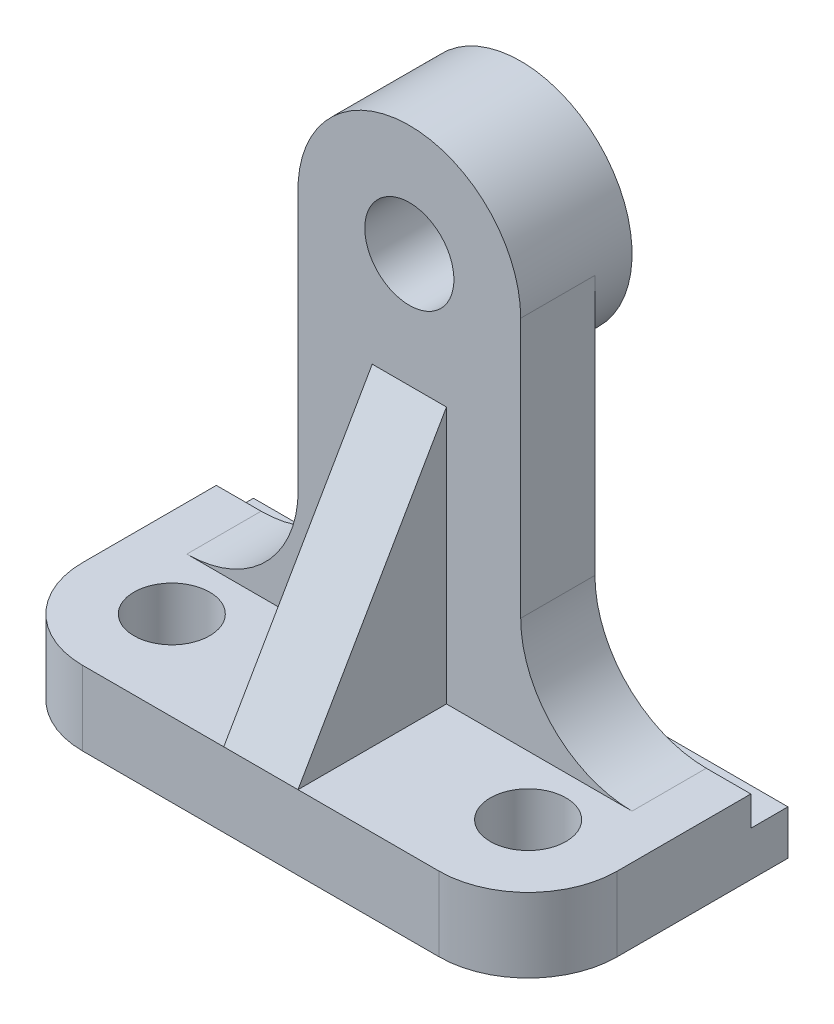
ISO-10303-21;
HEADER;
FILE_DESCRIPTION(('STEP AP214'),'2;1');
FILE_NAME('part.step','',(''),(''),'','','');
FILE_SCHEMA(('AUTOMOTIVE_DESIGN { 1 0 10303 214 1 1 1 1 }'));
ENDSEC;
DATA;
#1=APPLICATION_CONTEXT('core data for automotive mechanical design processes');
#2=APPLICATION_PROTOCOL_DEFINITION('international standard','automotive_design',2000,#1);
#3=PRODUCT_CONTEXT('',#1,'mechanical');
#4=PRODUCT('Part','Part','',(#3));
#5=PRODUCT_RELATED_PRODUCT_CATEGORY('part','',(#4));
#6=PRODUCT_DEFINITION_FORMATION('','',#4);
#7=PRODUCT_DEFINITION_CONTEXT('part definition',#1,'design');
#8=PRODUCT_DEFINITION('design','',#6,#7);
#9=PRODUCT_DEFINITION_SHAPE('','',#8);
#10=(LENGTH_UNIT() NAMED_UNIT(*) SI_UNIT(.MILLI.,.METRE.));
#11=(NAMED_UNIT(*) PLANE_ANGLE_UNIT() SI_UNIT($,.RADIAN.));
#12=(NAMED_UNIT(*) SI_UNIT($,.STERADIAN.) SOLID_ANGLE_UNIT());
#13=UNCERTAINTY_MEASURE_WITH_UNIT(LENGTH_MEASURE(1.E-05),#10,'distance_accuracy_value','');
#14=(GEOMETRIC_REPRESENTATION_CONTEXT(3) GLOBAL_UNCERTAINTY_ASSIGNED_CONTEXT((#13)) GLOBAL_UNIT_ASSIGNED_CONTEXT((#10,
#11,#12)) REPRESENTATION_CONTEXT('',''));
#15=CARTESIAN_POINT('',(0.,0.,0.));
#16=DIRECTION('',(0.,0.,1.));
#17=DIRECTION('',(1.,0.,0.));
#18=AXIS2_PLACEMENT_3D('',#15,#16,#17);
#19=CARTESIAN_POINT('',(0.,10.,0.));
#20=DIRECTION('',(0.,1.,0.));
#21=DIRECTION('',(0.,0.,1.));
#22=AXIS2_PLACEMENT_3D('',#19,#20,#21);
#23=PLANE('',#22);
#24=CARTESIAN_POINT('',(-24.,10.,5.5));
#25=DIRECTION('',(0.,1.,0.));
#26=DIRECTION('',(0.,0.,1.));
#27=AXIS2_PLACEMENT_3D('',#24,#25,#26);
#28=CIRCLE('',#27,5.09999999999999);
#29=CARTESIAN_POINT('',(-24.,10.,10.6));
#30=VERTEX_POINT('',#29);
#31=EDGE_CURVE('E449',#30,#30,#28,.T.);
#32=ORIENTED_EDGE('',*,*,#31,.F.);
#33=EDGE_LOOP('',(#32));
#34=FACE_BOUND('',#33,.T.);
#35=DIRECTION('',(1.,0.,0.));
#36=VECTOR('',#35,1.);
#37=CARTESIAN_POINT('',(-36.,10.,17.5));
#38=LINE('',#37,#36);
#39=CARTESIAN_POINT('',(-24.,10.,17.5));
#40=VERTEX_POINT('',#39);
#41=CARTESIAN_POINT('',(-5.,10.,17.5));
#42=VERTEX_POINT('',#41);
#43=EDGE_CURVE('E190',#40,#42,#38,.T.);
#44=ORIENTED_EDGE('',*,*,#43,.T.);
#45=DIRECTION('',(0.,0.,-1.));
#46=VECTOR('',#45,1.);
#47=CARTESIAN_POINT('',(-5.,10.,0.));
#48=LINE('',#47,#46);
#49=CARTESIAN_POINT('',(-5.,10.,-2.5));
#50=VERTEX_POINT('',#49);
#51=EDGE_CURVE('E165',#42,#50,#48,.T.);
#52=ORIENTED_EDGE('',*,*,#51,.T.);
#53=DIRECTION('',(-1.,0.,0.));
#54=VECTOR('',#53,1.);
#55=CARTESIAN_POINT('',(-14.9709910407704,10.,-2.49999999999999));
#56=LINE('',#55,#54);
#57=CARTESIAN_POINT('',(-29.9709910407704,10.,-2.49999999999999));
#58=VERTEX_POINT('',#57);
#59=EDGE_CURVE('E319',#50,#58,#56,.T.);
#60=ORIENTED_EDGE('',*,*,#59,.T.);
#61=DIRECTION('',(0.,0.,-1.));
#62=VECTOR('',#61,1.);
#63=CARTESIAN_POINT('',(-29.9709910407704,10.,-12.5));
#64=LINE('',#63,#62);
#65=CARTESIAN_POINT('',(-29.9709910407704,10.,-12.5));
#66=VERTEX_POINT('',#65);
#67=EDGE_CURVE('E268',#58,#66,#64,.T.);
#68=ORIENTED_EDGE('',*,*,#67,.T.);
#69=DIRECTION('',(1.,0.,0.));
#70=VECTOR('',#69,1.);
#71=CARTESIAN_POINT('',(0.,10.,-12.5));
#72=LINE('',#71,#70);
#73=CARTESIAN_POINT('',(-36.,10.,-12.5));
#74=VERTEX_POINT('',#73);
#75=EDGE_CURVE('E256',#74,#66,#72,.T.);
#76=ORIENTED_EDGE('',*,*,#75,.F.);
#77=DIRECTION('',(0.,0.,1.));
#78=VECTOR('',#77,1.);
#79=CARTESIAN_POINT('',(-36.,10.,-17.5));
#80=LINE('',#79,#78);
#81=CARTESIAN_POINT('',(-36.,10.,5.5));
#82=VERTEX_POINT('',#81);
#83=EDGE_CURVE('E207',#74,#82,#80,.T.);
#84=ORIENTED_EDGE('',*,*,#83,.T.);
#85=CARTESIAN_POINT('',(-24.,10.,5.5));
#86=DIRECTION('',(0.,1.,0.));
#87=DIRECTION('',(0.,0.,1.));
#88=AXIS2_PLACEMENT_3D('',#85,#86,#87);
#89=CIRCLE('',#88,12.);
#90=EDGE_CURVE('E198',#82,#40,#89,.T.);
#91=ORIENTED_EDGE('',*,*,#90,.T.);
#92=EDGE_LOOP('',(#44,#52,#60,#68,#76,#84,#91));
#93=FACE_BOUND('',#92,.T.);
#94=ADVANCED_FACE('F43',(#34,#93),#23,.T.);
#95=CARTESIAN_POINT('',(-53.0000000000001,10.,-12.5));
#96=DIRECTION('',(0.,0.,1.));
#97=DIRECTION('',(1.,0.,0.));
#98=AXIS2_PLACEMENT_3D('',#95,#96,#97);
#99=PLANE('',#98);
#100=DIRECTION('',(0.,-1.,0.));
#101=VECTOR('',#100,1.);
#102=CARTESIAN_POINT('',(36.,10.,-12.5));
#103=LINE('',#102,#101);
#104=CARTESIAN_POINT('',(36.,10.,-12.5));
#105=VERTEX_POINT('',#104);
#106=CARTESIAN_POINT('',(36.,6.,-12.5));
#107=VERTEX_POINT('',#106);
#108=EDGE_CURVE('E340',#105,#107,#103,.T.);
#109=ORIENTED_EDGE('',*,*,#108,.T.);
#110=DIRECTION('',(1.,0.,0.));
#111=VECTOR('',#110,1.);
#112=CARTESIAN_POINT('',(-53.0000000000001,6.,-12.5));
#113=LINE('',#112,#111);
#114=CARTESIAN_POINT('',(-36.,6.,-12.5));
#115=VERTEX_POINT('',#114);
#116=EDGE_CURVE('E349',#115,#107,#113,.T.);
#117=ORIENTED_EDGE('',*,*,#116,.F.);
#118=DIRECTION('',(0.,-1.,0.));
#119=VECTOR('',#118,1.);
#120=CARTESIAN_POINT('',(-36.,10.,-12.5));
#121=LINE('',#120,#119);
#122=EDGE_CURVE('E216',#74,#115,#121,.T.);
#123=ORIENTED_EDGE('',*,*,#122,.F.);
#124=ORIENTED_EDGE('',*,*,#75,.T.);
#125=CARTESIAN_POINT('',(-29.9709910407704,25.,-12.5));
#126=DIRECTION('',(0.,0.,1.));
#127=DIRECTION('',(1.,0.,0.));
#128=AXIS2_PLACEMENT_3D('',#125,#126,#127);
#129=CIRCLE('',#128,15.);
#130=CARTESIAN_POINT('',(-14.9709910407704,25.,-12.5));
#131=VERTEX_POINT('',#130);
#132=EDGE_CURVE('E279',#66,#131,#129,.T.);
#133=ORIENTED_EDGE('',*,*,#132,.T.);
#134=DIRECTION('',(0.,1.,0.));
#135=VECTOR('',#134,1.);
#136=CARTESIAN_POINT('',(-14.9709910407704,60.9324308323795,-12.5));
#137=LINE('',#136,#135);
#138=CARTESIAN_POINT('',(-14.9709910407704,59.0675691676204,-12.5));
#139=VERTEX_POINT('',#138);
#140=EDGE_CURVE('E331',#131,#139,#137,.T.);
#141=ORIENTED_EDGE('',*,*,#140,.T.);
#142=CARTESIAN_POINT('',(0.,60.,-12.5));
#143=DIRECTION('',(0.,0.,-1.));
#144=DIRECTION('',(-1.,0.,0.));
#145=AXIS2_PLACEMENT_3D('',#142,#143,#144);
#146=CIRCLE('',#145,15.);
#147=CARTESIAN_POINT('',(15.,60.,-12.5));
#148=VERTEX_POINT('',#147);
#149=EDGE_CURVE('E67',#148,#139,#146,.T.);
#150=ORIENTED_EDGE('',*,*,#149,.F.);
#151=DIRECTION('',(0.,-1.,0.));
#152=VECTOR('',#151,1.);
#153=CARTESIAN_POINT('',(15.,10.,-12.5));
#154=LINE('',#153,#152);
#155=CARTESIAN_POINT('',(15.,25.,-12.5));
#156=VERTEX_POINT('',#155);
#157=EDGE_CURVE('E292',#148,#156,#154,.T.);
#158=ORIENTED_EDGE('',*,*,#157,.T.);
#159=CARTESIAN_POINT('',(30.,25.,-12.5));
#160=DIRECTION('',(0.,0.,1.));
#161=DIRECTION('',(1.,0.,0.));
#162=AXIS2_PLACEMENT_3D('',#159,#160,#161);
#163=CIRCLE('',#162,15.);
#164=CARTESIAN_POINT('',(30.,10.,-12.5));
#165=VERTEX_POINT('',#164);
#166=EDGE_CURVE('E52',#156,#165,#163,.T.);
#167=ORIENTED_EDGE('',*,*,#166,.T.);
#168=EDGE_CURVE('E255',#165,#105,#72,.T.);
#169=ORIENTED_EDGE('',*,*,#168,.T.);
#170=EDGE_LOOP('',(#109,#117,#123,#124,#133,#141,#150,#158,#167,#169));
#171=FACE_BOUND('',#170,.T.);
#172=ADVANCED_FACE('F290',(#171),#99,.F.);
#173=CARTESIAN_POINT('',(36.,10.,-17.5));
#174=DIRECTION('',(-1.,0.,0.));
#175=DIRECTION('',(0.,0.,1.));
#176=AXIS2_PLACEMENT_3D('',#173,#174,#175);
#177=PLANE('',#176);
#178=DIRECTION('',(0.,-1.,0.));
#179=VECTOR('',#178,1.);
#180=CARTESIAN_POINT('',(36.,10.,-17.5));
#181=LINE('',#180,#179);
#182=CARTESIAN_POINT('',(36.,6.,-17.5));
#183=VERTEX_POINT('',#182);
#184=CARTESIAN_POINT('',(36.,0.,-17.5));
#185=VERTEX_POINT('',#184);
#186=EDGE_CURVE('E205',#183,#185,#181,.T.);
#187=ORIENTED_EDGE('',*,*,#186,.F.);
#188=DIRECTION('',(0.,0.,-1.));
#189=VECTOR('',#188,1.);
#190=CARTESIAN_POINT('',(36.,6.,-17.5));
#191=LINE('',#190,#189);
#192=EDGE_CURVE('E345',#107,#183,#191,.T.);
#193=ORIENTED_EDGE('',*,*,#192,.F.);
#194=ORIENTED_EDGE('',*,*,#108,.F.);
#195=DIRECTION('',(0.,0.,-1.));
#196=VECTOR('',#195,1.);
#197=CARTESIAN_POINT('',(36.,10.,-17.5));
#198=LINE('',#197,#196);
#199=CARTESIAN_POINT('',(36.,10.,5.5));
#200=VERTEX_POINT('',#199);
#201=EDGE_CURVE('E225',#200,#105,#198,.T.);
#202=ORIENTED_EDGE('',*,*,#201,.F.);
#203=DIRECTION('',(0.,-1.,0.));
#204=VECTOR('',#203,1.);
#205=CARTESIAN_POINT('',(36.,10.,5.5));
#206=LINE('',#205,#204);
#207=CARTESIAN_POINT('',(36.,0.,5.5));
#208=VERTEX_POINT('',#207);
#209=EDGE_CURVE('E251',#200,#208,#206,.T.);
#210=ORIENTED_EDGE('',*,*,#209,.T.);
#211=DIRECTION('',(0.,0.,-1.));
#212=VECTOR('',#211,1.);
#213=CARTESIAN_POINT('',(36.,0.,-17.5));
#214=LINE('',#213,#212);
#215=EDGE_CURVE('E211',#208,#185,#214,.T.);
#216=ORIENTED_EDGE('',*,*,#215,.T.);
#217=EDGE_LOOP('',(#187,#193,#194,#202,#210,#216));
#218=FACE_BOUND('',#217,.T.);
#219=ADVANCED_FACE('F380',(#218),#177,.F.);
#220=CARTESIAN_POINT('',(-36.,10.,-17.5));
#221=DIRECTION('',(0.,0.,1.));
#222=DIRECTION('',(1.,0.,0.));
#223=AXIS2_PLACEMENT_3D('',#220,#221,#222);
#224=PLANE('',#223);
#225=DIRECTION('',(-1.,0.,0.));
#226=VECTOR('',#225,1.);
#227=CARTESIAN_POINT('',(-36.,0.,-17.5));
#228=LINE('',#227,#226);
#229=CARTESIAN_POINT('',(-36.,0.,-17.5));
#230=VERTEX_POINT('',#229);
#231=EDGE_CURVE('E215',#185,#230,#228,.T.);
#232=ORIENTED_EDGE('',*,*,#231,.T.);
#233=DIRECTION('',(0.,-1.,0.));
#234=VECTOR('',#233,1.);
#235=CARTESIAN_POINT('',(-36.,10.,-17.5));
#236=LINE('',#235,#234);
#237=CARTESIAN_POINT('',(-36.,6.,-17.5));
#238=VERTEX_POINT('',#237);
#239=EDGE_CURVE('E200',#238,#230,#236,.T.);
#240=ORIENTED_EDGE('',*,*,#239,.F.);
#241=DIRECTION('',(1.,0.,0.));
#242=VECTOR('',#241,1.);
#243=CARTESIAN_POINT('',(-53.0000000000001,6.,-17.5));
#244=LINE('',#243,#242);
#245=EDGE_CURVE('E350',#238,#183,#244,.T.);
#246=ORIENTED_EDGE('',*,*,#245,.T.);
#247=ORIENTED_EDGE('',*,*,#186,.T.);
#248=EDGE_LOOP('',(#232,#240,#246,#247));
#249=FACE_BOUND('',#248,.T.);
#250=ADVANCED_FACE('F386',(#249),#224,.F.);
#251=CARTESIAN_POINT('',(-36.,10.,-17.5));
#252=DIRECTION('',(1.,0.,0.));
#253=DIRECTION('',(0.,0.,-1.));
#254=AXIS2_PLACEMENT_3D('',#251,#252,#253);
#255=PLANE('',#254);
#256=ORIENTED_EDGE('',*,*,#122,.T.);
#257=DIRECTION('',(0.,0.,-1.));
#258=VECTOR('',#257,1.);
#259=CARTESIAN_POINT('',(-36.,6.,-17.5));
#260=LINE('',#259,#258);
#261=EDGE_CURVE('E260',#115,#238,#260,.T.);
#262=ORIENTED_EDGE('',*,*,#261,.T.);
#263=ORIENTED_EDGE('',*,*,#239,.T.);
#264=DIRECTION('',(0.,0.,1.));
#265=VECTOR('',#264,1.);
#266=CARTESIAN_POINT('',(-36.,0.,-17.5));
#267=LINE('',#266,#265);
#268=CARTESIAN_POINT('',(-36.,0.,5.5));
#269=VERTEX_POINT('',#268);
#270=EDGE_CURVE('E219',#230,#269,#267,.T.);
#271=ORIENTED_EDGE('',*,*,#270,.T.);
#272=DIRECTION('',(0.,-1.,0.));
#273=VECTOR('',#272,1.);
#274=CARTESIAN_POINT('',(-36.,10.,5.5));
#275=LINE('',#274,#273);
#276=EDGE_CURVE('E242',#269,#82,#275,.F.);
#277=ORIENTED_EDGE('',*,*,#276,.T.);
#278=ORIENTED_EDGE('',*,*,#83,.F.);
#279=EDGE_LOOP('',(#256,#262,#263,#271,#277,#278));
#280=FACE_BOUND('',#279,.T.);
#281=ADVANCED_FACE('F363',(#280),#255,.F.);
#282=CARTESIAN_POINT('',(-36.,10.,17.5));
#283=DIRECTION('',(0.,0.,-1.));
#284=DIRECTION('',(-1.,0.,0.));
#285=AXIS2_PLACEMENT_3D('',#282,#283,#284);
#286=PLANE('',#285);
#287=CARTESIAN_POINT('',(5.,10.,17.5));
#288=VERTEX_POINT('',#287);
#289=CARTESIAN_POINT('',(24.,10.,17.5));
#290=VERTEX_POINT('',#289);
#291=EDGE_CURVE('E193',#288,#290,#38,.T.);
#292=ORIENTED_EDGE('',*,*,#291,.F.);
#293=DIRECTION('',(-1.,0.,0.));
#294=VECTOR('',#293,1.);
#295=CARTESIAN_POINT('',(0.,10.,17.5));
#296=LINE('',#295,#294);
#297=EDGE_CURVE('E179',#42,#288,#296,.F.);
#298=ORIENTED_EDGE('',*,*,#297,.F.);
#299=ORIENTED_EDGE('',*,*,#43,.F.);
#300=DIRECTION('',(0.,-1.,0.));
#301=VECTOR('',#300,1.);
#302=CARTESIAN_POINT('',(-24.,10.,17.5));
#303=LINE('',#302,#301);
#304=CARTESIAN_POINT('',(-24.,0.,17.5));
#305=VERTEX_POINT('',#304);
#306=EDGE_CURVE('E232',#40,#305,#303,.T.);
#307=ORIENTED_EDGE('',*,*,#306,.T.);
#308=DIRECTION('',(1.,0.,0.));
#309=VECTOR('',#308,1.);
#310=CARTESIAN_POINT('',(-36.,0.,17.5));
#311=LINE('',#310,#309);
#312=CARTESIAN_POINT('',(24.,0.,17.5));
#313=VERTEX_POINT('',#312);
#314=EDGE_CURVE('E223',#305,#313,#311,.T.);
#315=ORIENTED_EDGE('',*,*,#314,.T.);
#316=DIRECTION('',(0.,-1.,0.));
#317=VECTOR('',#316,1.);
#318=CARTESIAN_POINT('',(24.,10.,17.5));
#319=LINE('',#318,#317);
#320=EDGE_CURVE('E229',#313,#290,#319,.F.);
#321=ORIENTED_EDGE('',*,*,#320,.T.);
#322=EDGE_LOOP('',(#292,#298,#299,#307,#315,#321));
#323=FACE_BOUND('',#322,.T.);
#324=ADVANCED_FACE('F188',(#323),#286,.F.);
#325=DIRECTION('',(0.,0.,-1.));
#326=VECTOR('',#325,1.);
#327=CARTESIAN_POINT('',(5.,10.,0.));
#328=LINE('',#327,#326);
#329=CARTESIAN_POINT('',(5.,10.,-2.5));
#330=VERTEX_POINT('',#329);
#331=EDGE_CURVE('E479',#288,#330,#328,.T.);
#332=ORIENTED_EDGE('',*,*,#331,.F.);
#333=ORIENTED_EDGE('',*,*,#291,.T.);
#334=CARTESIAN_POINT('',(24.,10.,5.5));
#335=DIRECTION('',(0.,1.,0.));
#336=DIRECTION('',(0.,0.,1.));
#337=AXIS2_PLACEMENT_3D('',#334,#335,#336);
#338=CIRCLE('',#337,12.);
#339=EDGE_CURVE('E246',#290,#200,#338,.T.);
#340=ORIENTED_EDGE('',*,*,#339,.T.);
#341=ORIENTED_EDGE('',*,*,#201,.T.);
#342=ORIENTED_EDGE('',*,*,#168,.F.);
#343=DIRECTION('',(0.,0.,-1.));
#344=VECTOR('',#343,1.);
#345=CARTESIAN_POINT('',(30.,10.,-2.5));
#346=LINE('',#345,#344);
#347=CARTESIAN_POINT('',(30.,10.,-2.5));
#348=VERTEX_POINT('',#347);
#349=EDGE_CURVE('E264',#165,#348,#346,.F.);
#350=ORIENTED_EDGE('',*,*,#349,.T.);
#351=EDGE_CURVE('E314',#348,#330,#56,.T.);
#352=ORIENTED_EDGE('',*,*,#351,.T.);
#353=EDGE_LOOP('',(#332,#333,#340,#341,#342,#350,#352));
#354=FACE_BOUND('',#353,.T.);
#355=CARTESIAN_POINT('',(24.,10.,5.5));
#356=DIRECTION('',(0.,1.,0.));
#357=DIRECTION('',(0.,0.,1.));
#358=AXIS2_PLACEMENT_3D('',#355,#356,#357);
#359=CIRCLE('',#358,5.09999999999999);
#360=CARTESIAN_POINT('',(24.,10.,10.6));
#361=VERTEX_POINT('',#360);
#362=EDGE_CURVE('E457',#361,#361,#359,.T.);
#363=ORIENTED_EDGE('',*,*,#362,.F.);
#364=EDGE_LOOP('',(#363));
#365=FACE_BOUND('',#364,.T.);
#366=ADVANCED_FACE('F299',(#354,#365),#23,.T.);
#367=CARTESIAN_POINT('',(0.,0.,0.));
#368=DIRECTION('',(0.,1.,0.));
#369=DIRECTION('',(0.,0.,1.));
#370=AXIS2_PLACEMENT_3D('',#367,#368,#369);
#371=PLANE('',#370);
#372=CARTESIAN_POINT('',(24.,0.,5.5));
#373=DIRECTION('',(0.,1.,0.));
#374=DIRECTION('',(0.,0.,1.));
#375=AXIS2_PLACEMENT_3D('',#372,#373,#374);
#376=CIRCLE('',#375,5.09999999999999);
#377=CARTESIAN_POINT('',(24.,0.,10.6));
#378=VERTEX_POINT('',#377);
#379=EDGE_CURVE('E453',#378,#378,#376,.T.);
#380=ORIENTED_EDGE('',*,*,#379,.T.);
#381=EDGE_LOOP('',(#380));
#382=FACE_BOUND('',#381,.T.);
#383=CARTESIAN_POINT('',(24.,0.,5.5));
#384=DIRECTION('',(0.,1.,0.));
#385=DIRECTION('',(0.,0.,1.));
#386=AXIS2_PLACEMENT_3D('',#383,#384,#385);
#387=CIRCLE('',#386,12.);
#388=EDGE_CURVE('E235',#208,#313,#387,.F.);
#389=ORIENTED_EDGE('',*,*,#388,.T.);
#390=ORIENTED_EDGE('',*,*,#314,.F.);
#391=CARTESIAN_POINT('',(-24.,0.,5.5));
#392=DIRECTION('',(0.,1.,0.));
#393=DIRECTION('',(0.,0.,1.));
#394=AXIS2_PLACEMENT_3D('',#391,#392,#393);
#395=CIRCLE('',#394,12.);
#396=EDGE_CURVE('E239',#305,#269,#395,.F.);
#397=ORIENTED_EDGE('',*,*,#396,.T.);
#398=ORIENTED_EDGE('',*,*,#270,.F.);
#399=ORIENTED_EDGE('',*,*,#231,.F.);
#400=ORIENTED_EDGE('',*,*,#215,.F.);
#401=EDGE_LOOP('',(#389,#390,#397,#398,#399,#400));
#402=FACE_BOUND('',#401,.T.);
#403=CARTESIAN_POINT('',(-24.,0.,5.5));
#404=DIRECTION('',(0.,1.,0.));
#405=DIRECTION('',(0.,0.,1.));
#406=AXIS2_PLACEMENT_3D('',#403,#404,#405);
#407=CIRCLE('',#406,5.09999999999999);
#408=CARTESIAN_POINT('',(-24.,0.,10.6));
#409=VERTEX_POINT('',#408);
#410=EDGE_CURVE('E445',#409,#409,#407,.T.);
#411=ORIENTED_EDGE('',*,*,#410,.T.);
#412=EDGE_LOOP('',(#411));
#413=FACE_BOUND('',#412,.T.);
#414=ADVANCED_FACE('F369',(#382,#402,#413),#371,.F.);
#415=CARTESIAN_POINT('',(-24.,10.,5.5));
#416=DIRECTION('',(0.,-1.,0.));
#417=DIRECTION('',(0.,0.,-1.));
#418=AXIS2_PLACEMENT_3D('',#415,#416,#417);
#419=CYLINDRICAL_SURFACE('',#418,12.);
#420=ORIENTED_EDGE('',*,*,#90,.F.);
#421=ORIENTED_EDGE('',*,*,#276,.F.);
#422=ORIENTED_EDGE('',*,*,#396,.F.);
#423=ORIENTED_EDGE('',*,*,#306,.F.);
#424=EDGE_LOOP('',(#420,#421,#422,#423));
#425=FACE_BOUND('',#424,.T.);
#426=ADVANCED_FACE('F366',(#425),#419,.T.);
#427=CARTESIAN_POINT('',(24.,10.,5.5));
#428=DIRECTION('',(0.,-1.,0.));
#429=DIRECTION('',(0.,0.,-1.));
#430=AXIS2_PLACEMENT_3D('',#427,#428,#429);
#431=CYLINDRICAL_SURFACE('',#430,12.);
#432=ORIENTED_EDGE('',*,*,#339,.F.);
#433=ORIENTED_EDGE('',*,*,#320,.F.);
#434=ORIENTED_EDGE('',*,*,#388,.F.);
#435=ORIENTED_EDGE('',*,*,#209,.F.);
#436=EDGE_LOOP('',(#432,#433,#434,#435));
#437=FACE_BOUND('',#436,.T.);
#438=ADVANCED_FACE('F377',(#437),#431,.T.);
#439=CARTESIAN_POINT('',(-53.0000000000001,6.,-17.5));
#440=DIRECTION('',(0.,-1.,0.));
#441=DIRECTION('',(0.,0.,-1.));
#442=AXIS2_PLACEMENT_3D('',#439,#440,#441);
#443=PLANE('',#442);
#444=ORIENTED_EDGE('',*,*,#192,.T.);
#445=ORIENTED_EDGE('',*,*,#245,.F.);
#446=ORIENTED_EDGE('',*,*,#261,.F.);
#447=ORIENTED_EDGE('',*,*,#116,.T.);
#448=EDGE_LOOP('',(#444,#445,#446,#447));
#449=FACE_BOUND('',#448,.T.);
#450=ADVANCED_FACE('F387',(#449),#443,.F.);
#451=CARTESIAN_POINT('',(-14.9709910407704,60.9324308323795,-2.49999999999999));
#452=DIRECTION('',(-1.,0.,0.));
#453=DIRECTION('',(0.,0.,1.));
#454=AXIS2_PLACEMENT_3D('',#451,#452,#453);
#455=PLANE('',#454);
#456=ORIENTED_EDGE('',*,*,#140,.F.);
#457=DIRECTION('',(0.,0.,-1.));
#458=VECTOR('',#457,1.);
#459=CARTESIAN_POINT('',(-14.9709910407704,25.,-2.49999999999999));
#460=LINE('',#459,#458);
#461=CARTESIAN_POINT('',(-14.9709910407704,25.,-2.49999999999999));
#462=VERTEX_POINT('',#461);
#463=EDGE_CURVE('E272',#131,#462,#460,.F.);
#464=ORIENTED_EDGE('',*,*,#463,.T.);
#465=DIRECTION('',(0.,1.,0.));
#466=VECTOR('',#465,1.);
#467=CARTESIAN_POINT('',(-14.9709910407704,60.9324308323795,-2.49999999999999));
#468=LINE('',#467,#466);
#469=CARTESIAN_POINT('',(-14.9709910407704,60.9324308323795,-2.49999999999999));
#470=VERTEX_POINT('',#469);
#471=EDGE_CURVE('E325',#462,#470,#468,.T.);
#472=ORIENTED_EDGE('',*,*,#471,.T.);
#473=DIRECTION('',(0.,0.,-1.));
#474=VECTOR('',#473,1.);
#475=CARTESIAN_POINT('',(-14.9709910407704,60.9324308323795,-2.49999999999999));
#476=LINE('',#475,#474);
#477=CARTESIAN_POINT('',(-14.9709910407704,60.9324308323795,-12.5));
#478=VERTEX_POINT('',#477);
#479=EDGE_CURVE('E330',#470,#478,#476,.T.);
#480=ORIENTED_EDGE('',*,*,#479,.T.);
#481=DIRECTION('',(0.,-1.,0.));
#482=VECTOR('',#481,1.);
#483=CARTESIAN_POINT('',(-14.9709910407704,60.9324308323795,-12.5));
#484=LINE('',#483,#482);
#485=EDGE_CURVE('E461',#478,#139,#484,.T.);
#486=ORIENTED_EDGE('',*,*,#485,.T.);
#487=EDGE_LOOP('',(#456,#464,#472,#480,#486));
#488=FACE_BOUND('',#487,.T.);
#489=ADVANCED_FACE('F389',(#488),#455,.T.);
#490=CARTESIAN_POINT('',(15.,10.,-2.5));
#491=DIRECTION('',(1.,0.,0.));
#492=DIRECTION('',(0.,0.,-1.));
#493=AXIS2_PLACEMENT_3D('',#490,#491,#492);
#494=PLANE('',#493);
#495=DIRECTION('',(0.,-1.,0.));
#496=VECTOR('',#495,1.);
#497=CARTESIAN_POINT('',(15.,10.,-2.5));
#498=LINE('',#497,#496);
#499=CARTESIAN_POINT('',(15.,60.,-2.5));
#500=VERTEX_POINT('',#499);
#501=CARTESIAN_POINT('',(15.,25.,-2.5));
#502=VERTEX_POINT('',#501);
#503=EDGE_CURVE('E312',#500,#502,#498,.T.);
#504=ORIENTED_EDGE('',*,*,#503,.T.);
#505=DIRECTION('',(0.,0.,-1.));
#506=VECTOR('',#505,1.);
#507=CARTESIAN_POINT('',(15.,25.,-12.5));
#508=LINE('',#507,#506);
#509=EDGE_CURVE('E275',#502,#156,#508,.T.);
#510=ORIENTED_EDGE('',*,*,#509,.T.);
#511=ORIENTED_EDGE('',*,*,#157,.F.);
#512=DIRECTION('',(0.,0.,-1.));
#513=VECTOR('',#512,1.);
#514=CARTESIAN_POINT('',(15.,60.,-2.5));
#515=LINE('',#514,#513);
#516=EDGE_CURVE('E317',#500,#148,#515,.T.);
#517=ORIENTED_EDGE('',*,*,#516,.F.);
#518=EDGE_LOOP('',(#504,#510,#511,#517));
#519=FACE_BOUND('',#518,.T.);
#520=ADVANCED_FACE('F316',(#519),#494,.T.);
#521=CARTESIAN_POINT('',(0.,60.,-2.5));
#522=DIRECTION('',(0.,0.,-1.));
#523=DIRECTION('',(-1.,0.,0.));
#524=AXIS2_PLACEMENT_3D('',#521,#522,#523);
#525=CYLINDRICAL_SURFACE('',#524,15.);
#526=ORIENTED_EDGE('',*,*,#149,.T.);
#527=EDGE_CURVE('E465',#139,#478,#146,.T.);
#528=ORIENTED_EDGE('',*,*,#527,.T.);
#529=ORIENTED_EDGE('',*,*,#479,.F.);
#530=CARTESIAN_POINT('',(0.,60.,-2.5));
#531=DIRECTION('',(0.,0.,-1.));
#532=DIRECTION('',(1.,0.,0.));
#533=AXIS2_PLACEMENT_3D('',#530,#531,#532);
#534=CIRCLE('',#533,15.);
#535=EDGE_CURVE('E320',#470,#500,#534,.T.);
#536=ORIENTED_EDGE('',*,*,#535,.T.);
#537=ORIENTED_EDGE('',*,*,#516,.T.);
#538=EDGE_LOOP('',(#526,#528,#529,#536,#537));
#539=FACE_BOUND('',#538,.T.);
#540=CARTESIAN_POINT('',(0.,60.,-17.5));
#541=DIRECTION('',(0.,0.,-1.));
#542=DIRECTION('',(-1.,0.,0.));
#543=AXIS2_PLACEMENT_3D('',#540,#541,#542);
#544=CIRCLE('',#543,15.);
#545=CARTESIAN_POINT('',(-15.,60.,-17.5));
#546=VERTEX_POINT('',#545);
#547=EDGE_CURVE('E464',#546,#546,#544,.T.);
#548=ORIENTED_EDGE('',*,*,#547,.F.);
#549=EDGE_LOOP('',(#548));
#550=FACE_BOUND('',#549,.T.);
#551=ADVANCED_FACE('F513',(#539,#550),#525,.T.);
#552=CARTESIAN_POINT('',(0.,60.,-2.5));
#553=DIRECTION('',(0.,0.,1.));
#554=DIRECTION('',(1.,0.,0.));
#555=AXIS2_PLACEMENT_3D('',#552,#553,#554);
#556=PLANE('',#555);
#557=DIRECTION('',(0.,1.,0.));
#558=VECTOR('',#557,1.);
#559=CARTESIAN_POINT('',(5.,60.,-2.5));
#560=LINE('',#559,#558);
#561=CARTESIAN_POINT('',(5.,44.6410161513775,-2.5));
#562=VERTEX_POINT('',#561);
#563=EDGE_CURVE('E476',#330,#562,#560,.T.);
#564=ORIENTED_EDGE('',*,*,#563,.F.);
#565=ORIENTED_EDGE('',*,*,#351,.F.);
#566=CARTESIAN_POINT('',(30.,25.,-2.5));
#567=DIRECTION('',(0.,0.,1.));
#568=DIRECTION('',(1.,0.,0.));
#569=AXIS2_PLACEMENT_3D('',#566,#567,#568);
#570=CIRCLE('',#569,15.);
#571=EDGE_CURVE('E11',#348,#502,#570,.F.);
#572=ORIENTED_EDGE('',*,*,#571,.T.);
#573=ORIENTED_EDGE('',*,*,#503,.F.);
#574=ORIENTED_EDGE('',*,*,#535,.F.);
#575=ORIENTED_EDGE('',*,*,#471,.F.);
#576=CARTESIAN_POINT('',(-29.9709910407704,25.,-2.49999999999999));
#577=DIRECTION('',(0.,0.,1.));
#578=DIRECTION('',(1.,0.,0.));
#579=AXIS2_PLACEMENT_3D('',#576,#577,#578);
#580=CIRCLE('',#579,15.);
#581=EDGE_CURVE('E282',#462,#58,#580,.F.);
#582=ORIENTED_EDGE('',*,*,#581,.T.);
#583=ORIENTED_EDGE('',*,*,#59,.F.);
#584=DIRECTION('',(0.,1.,0.));
#585=VECTOR('',#584,1.);
#586=CARTESIAN_POINT('',(-5.,60.,-2.5));
#587=LINE('',#586,#585);
#588=CARTESIAN_POINT('',(-5.,44.6410161513775,-2.5));
#589=VERTEX_POINT('',#588);
#590=EDGE_CURVE('E168',#50,#589,#587,.T.);
#591=ORIENTED_EDGE('',*,*,#590,.T.);
#592=DIRECTION('',(1.,0.,0.));
#593=VECTOR('',#592,1.);
#594=CARTESIAN_POINT('',(0.,44.6410161513775,-2.5));
#595=LINE('',#594,#593);
#596=EDGE_CURVE('E182',#562,#589,#595,.F.);
#597=ORIENTED_EDGE('',*,*,#596,.F.);
#598=EDGE_LOOP('',(#564,#565,#572,#573,#574,#575,#582,#583,#591,#597));
#599=FACE_BOUND('',#598,.T.);
#600=CARTESIAN_POINT('',(0.,60.,-2.5));
#601=DIRECTION('',(0.,0.,-1.));
#602=DIRECTION('',(-1.,0.,0.));
#603=AXIS2_PLACEMENT_3D('',#600,#601,#602);
#604=CIRCLE('',#603,6.);
#605=CARTESIAN_POINT('',(-6.,60.,-2.5));
#606=VERTEX_POINT('',#605);
#607=EDGE_CURVE('E335',#606,#606,#604,.T.);
#608=ORIENTED_EDGE('',*,*,#607,.T.);
#609=EDGE_LOOP('',(#608));
#610=FACE_BOUND('',#609,.T.);
#611=ADVANCED_FACE('F309',(#599,#610),#556,.T.);
#612=CARTESIAN_POINT('',(0.,60.,-2.5));
#613=DIRECTION('',(0.,0.,-1.));
#614=DIRECTION('',(-1.,0.,0.));
#615=AXIS2_PLACEMENT_3D('',#612,#613,#614);
#616=CYLINDRICAL_SURFACE('',#615,6.);
#617=CARTESIAN_POINT('',(0.,60.,-17.5));
#618=DIRECTION('',(0.,0.,-1.));
#619=DIRECTION('',(-1.,0.,0.));
#620=AXIS2_PLACEMENT_3D('',#617,#618,#619);
#621=CIRCLE('',#620,6.);
#622=CARTESIAN_POINT('',(-6.,60.,-17.5));
#623=VERTEX_POINT('',#622);
#624=EDGE_CURVE('E195',#623,#623,#621,.T.);
#625=ORIENTED_EDGE('',*,*,#624,.T.);
#626=EDGE_LOOP('',(#625));
#627=FACE_BOUND('',#626,.T.);
#628=ORIENTED_EDGE('',*,*,#607,.F.);
#629=EDGE_LOOP('',(#628));
#630=FACE_BOUND('',#629,.T.);
#631=ADVANCED_FACE('F426',(#627,#630),#616,.F.);
#632=CARTESIAN_POINT('',(-29.9709910407704,25.,0.));
#633=DIRECTION('',(0.,0.,1.));
#634=DIRECTION('',(1.,0.,0.));
#635=AXIS2_PLACEMENT_3D('',#632,#633,#634);
#636=CYLINDRICAL_SURFACE('',#635,15.);
#637=ORIENTED_EDGE('',*,*,#581,.F.);
#638=ORIENTED_EDGE('',*,*,#463,.F.);
#639=ORIENTED_EDGE('',*,*,#132,.F.);
#640=ORIENTED_EDGE('',*,*,#67,.F.);
#641=EDGE_LOOP('',(#637,#638,#639,#640));
#642=FACE_BOUND('',#641,.T.);
#643=ADVANCED_FACE('F424',(#642),#636,.F.);
#644=CARTESIAN_POINT('',(30.,25.,-2.5));
#645=DIRECTION('',(0.,0.,1.));
#646=DIRECTION('',(1.,0.,0.));
#647=AXIS2_PLACEMENT_3D('',#644,#645,#646);
#648=CYLINDRICAL_SURFACE('',#647,15.);
#649=ORIENTED_EDGE('',*,*,#571,.F.);
#650=ORIENTED_EDGE('',*,*,#349,.F.);
#651=ORIENTED_EDGE('',*,*,#166,.F.);
#652=ORIENTED_EDGE('',*,*,#509,.F.);
#653=EDGE_LOOP('',(#649,#650,#651,#652));
#654=FACE_BOUND('',#653,.T.);
#655=ADVANCED_FACE('F45',(#654),#648,.F.);
#656=CARTESIAN_POINT('',(-24.,10.,5.5));
#657=DIRECTION('',(0.,1.,0.));
#658=DIRECTION('',(0.,0.,1.));
#659=AXIS2_PLACEMENT_3D('',#656,#657,#658);
#660=CYLINDRICAL_SURFACE('',#659,5.09999999999999);
#661=ORIENTED_EDGE('',*,*,#410,.F.);
#662=EDGE_LOOP('',(#661));
#663=FACE_BOUND('',#662,.T.);
#664=ORIENTED_EDGE('',*,*,#31,.T.);
#665=EDGE_LOOP('',(#664));
#666=FACE_BOUND('',#665,.T.);
#667=ADVANCED_FACE('F432',(#663,#666),#660,.F.);
#668=CARTESIAN_POINT('',(24.,10.,5.5));
#669=DIRECTION('',(0.,1.,0.));
#670=DIRECTION('',(0.,0.,1.));
#671=AXIS2_PLACEMENT_3D('',#668,#669,#670);
#672=CYLINDRICAL_SURFACE('',#671,5.09999999999999);
#673=ORIENTED_EDGE('',*,*,#379,.F.);
#674=EDGE_LOOP('',(#673));
#675=FACE_BOUND('',#674,.T.);
#676=ORIENTED_EDGE('',*,*,#362,.T.);
#677=EDGE_LOOP('',(#676));
#678=FACE_BOUND('',#677,.T.);
#679=ADVANCED_FACE('F500',(#675,#678),#672,.F.);
#680=CARTESIAN_POINT('',(0.,60.,-17.5));
#681=DIRECTION('',(0.,0.,-1.));
#682=DIRECTION('',(-1.,0.,0.));
#683=AXIS2_PLACEMENT_3D('',#680,#681,#682);
#684=PLANE('',#683);
#685=ORIENTED_EDGE('',*,*,#624,.F.);
#686=EDGE_LOOP('',(#685));
#687=FACE_BOUND('',#686,.T.);
#688=ORIENTED_EDGE('',*,*,#547,.T.);
#689=EDGE_LOOP('',(#688));
#690=FACE_BOUND('',#689,.T.);
#691=ADVANCED_FACE('F497',(#687,#690),#684,.T.);
#692=CARTESIAN_POINT('',(0.,60.,-12.5));
#693=DIRECTION('',(0.,0.,-1.));
#694=DIRECTION('',(-1.,0.,0.));
#695=AXIS2_PLACEMENT_3D('',#692,#693,#694);
#696=PLANE('',#695);
#697=ORIENTED_EDGE('',*,*,#485,.F.);
#698=ORIENTED_EDGE('',*,*,#527,.F.);
#699=EDGE_LOOP('',(#697,#698));
#700=FACE_BOUND('',#699,.T.);
#701=ADVANCED_FACE('F494',(#700),#696,.F.);
#702=CARTESIAN_POINT('',(0.,10.,17.5));
#703=DIRECTION('',(0.,-0.5,-0.866025403784439));
#704=DIRECTION('',(0.,0.866025403784439,-0.5));
#705=AXIS2_PLACEMENT_3D('',#702,#703,#704);
#706=PLANE('',#705);
#707=DIRECTION('',(0.,0.866025403784439,-0.5));
#708=VECTOR('',#707,1.);
#709=CARTESIAN_POINT('',(-5.,10.,17.5));
#710=LINE('',#709,#708);
#711=EDGE_CURVE('E59',#42,#589,#710,.T.);
#712=ORIENTED_EDGE('',*,*,#711,.F.);
#713=ORIENTED_EDGE('',*,*,#297,.T.);
#714=DIRECTION('',(0.,0.866025403784439,-0.5));
#715=VECTOR('',#714,1.);
#716=CARTESIAN_POINT('',(5.,10.,17.5));
#717=LINE('',#716,#715);
#718=EDGE_CURVE('E173',#288,#562,#717,.T.);
#719=ORIENTED_EDGE('',*,*,#718,.T.);
#720=ORIENTED_EDGE('',*,*,#596,.T.);
#721=EDGE_LOOP('',(#712,#713,#719,#720));
#722=FACE_BOUND('',#721,.T.);
#723=ADVANCED_FACE('F177',(#722),#706,.F.);
#724=CARTESIAN_POINT('',(5.,37.5,0.));
#725=DIRECTION('',(1.,0.,0.));
#726=DIRECTION('',(0.,0.,-1.));
#727=AXIS2_PLACEMENT_3D('',#724,#725,#726);
#728=PLANE('',#727);
#729=ORIENTED_EDGE('',*,*,#331,.T.);
#730=ORIENTED_EDGE('',*,*,#563,.T.);
#731=ORIENTED_EDGE('',*,*,#718,.F.);
#732=EDGE_LOOP('',(#729,#730,#731));
#733=FACE_BOUND('',#732,.T.);
#734=ADVANCED_FACE('F486',(#733),#728,.T.);
#735=CARTESIAN_POINT('',(-5.,37.5,0.));
#736=DIRECTION('',(1.,0.,0.));
#737=DIRECTION('',(0.,0.,-1.));
#738=AXIS2_PLACEMENT_3D('',#735,#736,#737);
#739=PLANE('',#738);
#740=ORIENTED_EDGE('',*,*,#590,.F.);
#741=ORIENTED_EDGE('',*,*,#51,.F.);
#742=ORIENTED_EDGE('',*,*,#711,.T.);
#743=EDGE_LOOP('',(#740,#741,#742));
#744=FACE_BOUND('',#743,.T.);
#745=ADVANCED_FACE('F166',(#744),#739,.F.);
#746=CLOSED_SHELL('',(#94,#172,#219,#250,#281,#324,#366,#414,#426,#438,#450,#489,#520,#551,#611,
#631,#643,#655,#667,#679,#691,#701,#723,#734,#745));
#747=MANIFOLD_SOLID_BREP('B2',#746);
#748=ADVANCED_BREP_SHAPE_REPRESENTATION('',(#18,#747),#14);
#749=SHAPE_DEFINITION_REPRESENTATION(#9,#748);
ENDSEC;
END-ISO-10303-21;
